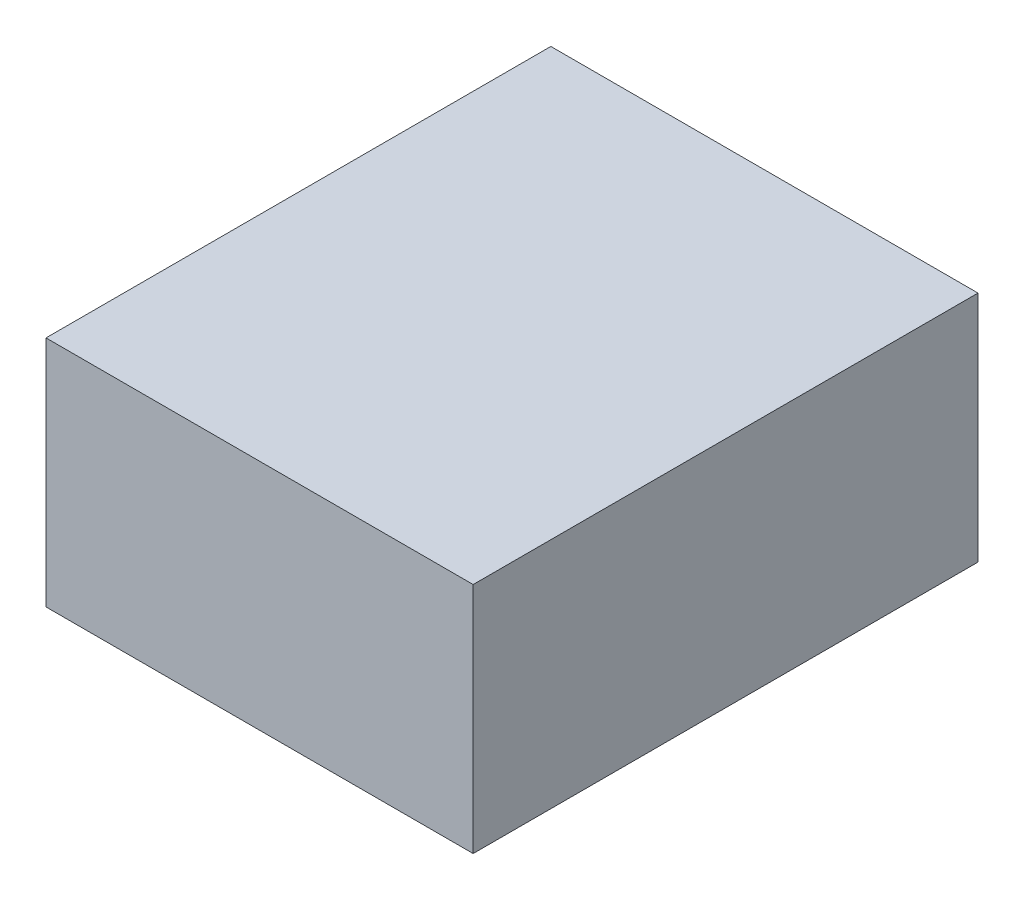
ISO-10303-21;
HEADER;
FILE_DESCRIPTION(('STEP AP214'),'2;1');
FILE_NAME('part.step','',(''),(''),'','','');
FILE_SCHEMA(('AUTOMOTIVE_DESIGN { 1 0 10303 214 1 1 1 1 }'));
ENDSEC;
DATA;
#1=APPLICATION_CONTEXT('core data for automotive mechanical design processes');
#2=APPLICATION_PROTOCOL_DEFINITION('international standard','automotive_design',2000,#1);
#3=PRODUCT_CONTEXT('',#1,'mechanical');
#4=PRODUCT('Part','Part','',(#3));
#5=PRODUCT_RELATED_PRODUCT_CATEGORY('part','',(#4));
#6=PRODUCT_DEFINITION_FORMATION('','',#4);
#7=PRODUCT_DEFINITION_CONTEXT('part definition',#1,'design');
#8=PRODUCT_DEFINITION('design','',#6,#7);
#9=PRODUCT_DEFINITION_SHAPE('','',#8);
#10=(LENGTH_UNIT() NAMED_UNIT(*) SI_UNIT(.MILLI.,.METRE.));
#11=(NAMED_UNIT(*) PLANE_ANGLE_UNIT() SI_UNIT($,.RADIAN.));
#12=(NAMED_UNIT(*) SI_UNIT($,.STERADIAN.) SOLID_ANGLE_UNIT());
#13=UNCERTAINTY_MEASURE_WITH_UNIT(LENGTH_MEASURE(1.E-05),#10,'distance_accuracy_value','');
#14=(GEOMETRIC_REPRESENTATION_CONTEXT(3) GLOBAL_UNCERTAINTY_ASSIGNED_CONTEXT((#13)) GLOBAL_UNIT_ASSIGNED_CONTEXT((#10,
#11,#12)) REPRESENTATION_CONTEXT('',''));
#15=CARTESIAN_POINT('',(0.,0.,0.));
#16=DIRECTION('',(0.,0.,1.));
#17=DIRECTION('',(1.,0.,0.));
#18=AXIS2_PLACEMENT_3D('',#15,#16,#17);
#19=CARTESIAN_POINT('',(-0.5499989,-0.2999994,0.));
#20=DIRECTION('',(0.,1.,0.));
#21=DIRECTION('',(0.,0.,1.));
#22=AXIS2_PLACEMENT_3D('',#19,#20,#21);
#23=PLANE('',#22);
#24=DIRECTION('',(0.,0.,1.));
#25=VECTOR('',#24,1.);
#26=CARTESIAN_POINT('',(0.5499989,-0.2999994,0.));
#27=LINE('',#26,#25);
#28=CARTESIAN_POINT('',(0.5499989,-0.2999994,0.));
#29=VERTEX_POINT('',#28);
#30=CARTESIAN_POINT('',(0.5499989,-0.2999994,1.29999994));
#31=VERTEX_POINT('',#30);
#32=EDGE_CURVE('E20',#29,#31,#27,.T.);
#33=ORIENTED_EDGE('',*,*,#32,.T.);
#34=DIRECTION('',(-1.,0.,0.));
#35=VECTOR('',#34,1.);
#36=CARTESIAN_POINT('',(0.5499989,-0.2999994,1.29999994));
#37=LINE('',#36,#35);
#38=CARTESIAN_POINT('',(-0.5499989,-0.2999994,1.29999994));
#39=VERTEX_POINT('',#38);
#40=EDGE_CURVE('E55',#31,#39,#37,.T.);
#41=ORIENTED_EDGE('',*,*,#40,.T.);
#42=DIRECTION('',(0.,0.,-1.));
#43=VECTOR('',#42,1.);
#44=CARTESIAN_POINT('',(-0.5499989,-0.2999994,0.));
#45=LINE('',#44,#43);
#46=CARTESIAN_POINT('',(-0.5499989,-0.2999994,0.));
#47=VERTEX_POINT('',#46);
#48=EDGE_CURVE('E76',#39,#47,#45,.T.);
#49=ORIENTED_EDGE('',*,*,#48,.T.);
#50=DIRECTION('',(-1.,0.,0.));
#51=VECTOR('',#50,1.);
#52=CARTESIAN_POINT('',(0.5499989,-0.2999994,0.));
#53=LINE('',#52,#51);
#54=EDGE_CURVE('E58',#29,#47,#53,.T.);
#55=ORIENTED_EDGE('',*,*,#54,.F.);
#56=EDGE_LOOP('',(#33,#41,#49,#55));
#57=FACE_BOUND('',#56,.T.);
#58=ADVANCED_FACE('F17',(#57),#23,.F.);
#59=CARTESIAN_POINT('',(0.5499989,-0.2999994,0.));
#60=DIRECTION('',(-1.,0.,0.));
#61=DIRECTION('',(0.,0.,1.));
#62=AXIS2_PLACEMENT_3D('',#59,#60,#61);
#63=PLANE('',#62);
#64=DIRECTION('',(0.,0.,-1.));
#65=VECTOR('',#64,1.);
#66=CARTESIAN_POINT('',(0.5499989,0.2999994,0.));
#67=LINE('',#66,#65);
#68=CARTESIAN_POINT('',(0.5499989,0.2999994,0.));
#69=VERTEX_POINT('',#68);
#70=CARTESIAN_POINT('',(0.5499989,0.2999994,1.29999994));
#71=VERTEX_POINT('',#70);
#72=EDGE_CURVE('E73',#69,#71,#67,.F.);
#73=ORIENTED_EDGE('',*,*,#72,.T.);
#74=DIRECTION('',(0.,1.,0.));
#75=VECTOR('',#74,1.);
#76=CARTESIAN_POINT('',(0.5499989,0.2999994,1.29999994));
#77=LINE('',#76,#75);
#78=EDGE_CURVE('E63',#71,#31,#77,.F.);
#79=ORIENTED_EDGE('',*,*,#78,.T.);
#80=ORIENTED_EDGE('',*,*,#32,.F.);
#81=DIRECTION('',(0.,1.,0.));
#82=VECTOR('',#81,1.);
#83=CARTESIAN_POINT('',(0.5499989,0.2999994,0.));
#84=LINE('',#83,#82);
#85=EDGE_CURVE('E78',#69,#29,#84,.F.);
#86=ORIENTED_EDGE('',*,*,#85,.F.);
#87=EDGE_LOOP('',(#73,#79,#80,#86));
#88=FACE_BOUND('',#87,.T.);
#89=ADVANCED_FACE('F72',(#88),#63,.F.);
#90=CARTESIAN_POINT('',(0.5499989,0.2999994,1.29999994));
#91=DIRECTION('',(0.,0.,-1.));
#92=DIRECTION('',(-1.,0.,0.));
#93=AXIS2_PLACEMENT_3D('',#90,#91,#92);
#94=PLANE('',#93);
#95=DIRECTION('',(0.,1.,0.));
#96=VECTOR('',#95,1.);
#97=CARTESIAN_POINT('',(-0.5499989,0.2999994,1.29999994));
#98=LINE('',#97,#96);
#99=CARTESIAN_POINT('',(-0.5499989,0.2999994,1.29999994));
#100=VERTEX_POINT('',#99);
#101=EDGE_CURVE('E69',#100,#39,#98,.F.);
#102=ORIENTED_EDGE('',*,*,#101,.T.);
#103=ORIENTED_EDGE('',*,*,#40,.F.);
#104=ORIENTED_EDGE('',*,*,#78,.F.);
#105=DIRECTION('',(1.,0.,0.));
#106=VECTOR('',#105,1.);
#107=CARTESIAN_POINT('',(0.5499989,0.2999994,1.29999994));
#108=LINE('',#107,#106);
#109=EDGE_CURVE('E83',#71,#100,#108,.F.);
#110=ORIENTED_EDGE('',*,*,#109,.T.);
#111=EDGE_LOOP('',(#102,#103,#104,#110));
#112=FACE_BOUND('',#111,.T.);
#113=ADVANCED_FACE('F66',(#112),#94,.F.);
#114=CARTESIAN_POINT('',(-0.5499989,0.2999994,0.));
#115=DIRECTION('',(1.,0.,0.));
#116=DIRECTION('',(0.,0.,-1.));
#117=AXIS2_PLACEMENT_3D('',#114,#115,#116);
#118=PLANE('',#117);
#119=ORIENTED_EDGE('',*,*,#48,.F.);
#120=ORIENTED_EDGE('',*,*,#101,.F.);
#121=DIRECTION('',(0.,0.,-1.));
#122=VECTOR('',#121,1.);
#123=CARTESIAN_POINT('',(-0.5499989,0.2999994,0.));
#124=LINE('',#123,#122);
#125=CARTESIAN_POINT('',(-0.5499989,0.2999994,0.));
#126=VERTEX_POINT('',#125);
#127=EDGE_CURVE('E26',#100,#126,#124,.T.);
#128=ORIENTED_EDGE('',*,*,#127,.T.);
#129=DIRECTION('',(0.,1.,0.));
#130=VECTOR('',#129,1.);
#131=CARTESIAN_POINT('',(-0.5499989,0.2999994,0.));
#132=LINE('',#131,#130);
#133=EDGE_CURVE('E34',#47,#126,#132,.T.);
#134=ORIENTED_EDGE('',*,*,#133,.F.);
#135=EDGE_LOOP('',(#119,#120,#128,#134));
#136=FACE_BOUND('',#135,.T.);
#137=ADVANCED_FACE('F88',(#136),#118,.F.);
#138=CARTESIAN_POINT('',(0.5499989,0.2999994,0.));
#139=DIRECTION('',(0.,0.,-1.));
#140=DIRECTION('',(-1.,0.,0.));
#141=AXIS2_PLACEMENT_3D('',#138,#139,#140);
#142=PLANE('',#141);
#143=ORIENTED_EDGE('',*,*,#133,.T.);
#144=DIRECTION('',(1.,0.,0.));
#145=VECTOR('',#144,1.);
#146=CARTESIAN_POINT('',(0.5499989,0.2999994,0.));
#147=LINE('',#146,#145);
#148=EDGE_CURVE('E11',#126,#69,#147,.T.);
#149=ORIENTED_EDGE('',*,*,#148,.T.);
#150=ORIENTED_EDGE('',*,*,#85,.T.);
#151=ORIENTED_EDGE('',*,*,#54,.T.);
#152=EDGE_LOOP('',(#143,#149,#150,#151));
#153=FACE_BOUND('',#152,.T.);
#154=ADVANCED_FACE('F91',(#153),#142,.T.);
#155=CARTESIAN_POINT('',(0.5499989,0.2999994,0.));
#156=DIRECTION('',(0.,-1.,0.));
#157=DIRECTION('',(0.,0.,-1.));
#158=AXIS2_PLACEMENT_3D('',#155,#156,#157);
#159=PLANE('',#158);
#160=ORIENTED_EDGE('',*,*,#127,.F.);
#161=ORIENTED_EDGE('',*,*,#109,.F.);
#162=ORIENTED_EDGE('',*,*,#72,.F.);
#163=ORIENTED_EDGE('',*,*,#148,.F.);
#164=EDGE_LOOP('',(#160,#161,#162,#163));
#165=FACE_BOUND('',#164,.T.);
#166=ADVANCED_FACE('F90',(#165),#159,.F.);
#167=CLOSED_SHELL('',(#58,#89,#113,#137,#154,#166));
#168=MANIFOLD_SOLID_BREP('B1',#167);
#169=ADVANCED_BREP_SHAPE_REPRESENTATION('',(#18,#168),#14);
#170=SHAPE_DEFINITION_REPRESENTATION(#9,#169);
ENDSEC;
END-ISO-10303-21;
